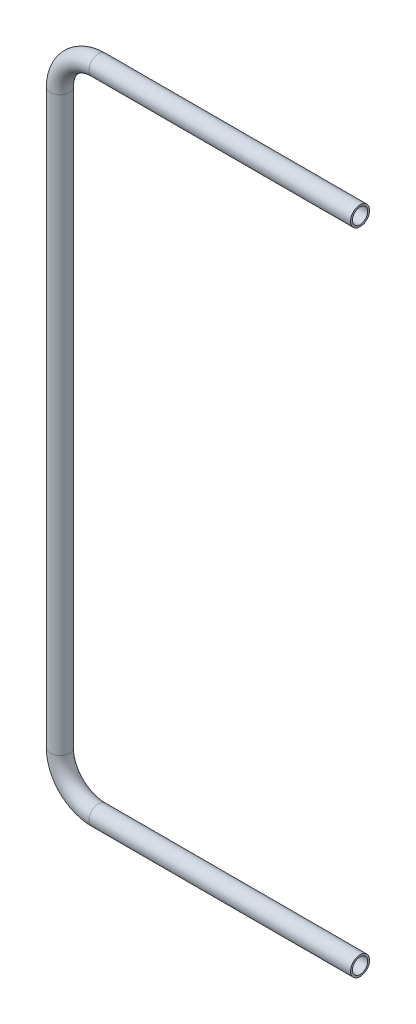
ISO-10303-21;
HEADER;
FILE_DESCRIPTION(('STEP AP214'),'2;1');
FILE_NAME('part.step','',(''),(''),'','','');
FILE_SCHEMA(('AUTOMOTIVE_DESIGN { 1 0 10303 214 1 1 1 1 }'));
ENDSEC;
DATA;
#1=APPLICATION_CONTEXT('core data for automotive mechanical design processes');
#2=APPLICATION_PROTOCOL_DEFINITION('international standard','automotive_design',2000,#1);
#3=PRODUCT_CONTEXT('',#1,'mechanical');
#4=PRODUCT('Part','Part','',(#3));
#5=PRODUCT_RELATED_PRODUCT_CATEGORY('part','',(#4));
#6=PRODUCT_DEFINITION_FORMATION('','',#4);
#7=PRODUCT_DEFINITION_CONTEXT('part definition',#1,'design');
#8=PRODUCT_DEFINITION('design','',#6,#7);
#9=PRODUCT_DEFINITION_SHAPE('','',#8);
#10=(LENGTH_UNIT() NAMED_UNIT(*) SI_UNIT(.MILLI.,.METRE.));
#11=(NAMED_UNIT(*) PLANE_ANGLE_UNIT() SI_UNIT($,.RADIAN.));
#12=(NAMED_UNIT(*) SI_UNIT($,.STERADIAN.) SOLID_ANGLE_UNIT());
#13=UNCERTAINTY_MEASURE_WITH_UNIT(LENGTH_MEASURE(1.E-05),#10,'distance_accuracy_value','');
#14=(GEOMETRIC_REPRESENTATION_CONTEXT(3) GLOBAL_UNCERTAINTY_ASSIGNED_CONTEXT((#13)) GLOBAL_UNIT_ASSIGNED_CONTEXT((#10,
#11,#12)) REPRESENTATION_CONTEXT('',''));
#15=CARTESIAN_POINT('',(0.,0.,0.));
#16=DIRECTION('',(0.,0.,1.));
#17=DIRECTION('',(1.,0.,0.));
#18=AXIS2_PLACEMENT_3D('',#15,#16,#17);
#19=CARTESIAN_POINT('',(0.,0.,0.));
#20=DIRECTION('',(-1.,0.,0.));
#21=DIRECTION('',(0.,-1.,0.));
#22=AXIS2_PLACEMENT_3D('',#19,#20,#21);
#23=CYLINDRICAL_SURFACE('',#22,16.7005);
#24=CARTESIAN_POINT('',(-457.2,0.,0.));
#25=DIRECTION('',(-1.,0.,0.));
#26=DIRECTION('',(0.,0.,1.));
#27=AXIS2_PLACEMENT_3D('',#24,#25,#26);
#28=CIRCLE('',#27,16.7005);
#29=CARTESIAN_POINT('',(-457.2,-16.7005000000001,0.));
#30=VERTEX_POINT('',#29);
#31=EDGE_CURVE('E84',#30,#30,#28,.T.);
#32=ORIENTED_EDGE('',*,*,#31,.F.);
#33=EDGE_LOOP('',(#32));
#34=FACE_BOUND('',#33,.T.);
#35=CARTESIAN_POINT('',(0.,0.,0.));
#36=DIRECTION('',(-1.,0.,0.));
#37=DIRECTION('',(0.,0.,1.));
#38=AXIS2_PLACEMENT_3D('',#35,#36,#37);
#39=CIRCLE('',#38,16.7005);
#40=CARTESIAN_POINT('',(0.,0.,16.7005));
#41=VERTEX_POINT('',#40);
#42=EDGE_CURVE('E52',#41,#41,#39,.T.);
#43=ORIENTED_EDGE('',*,*,#42,.T.);
#44=EDGE_LOOP('',(#43));
#45=FACE_BOUND('',#44,.T.);
#46=ADVANCED_FACE('F37',(#34,#45),#23,.T.);
#47=CARTESIAN_POINT('',(-457.2,67.5004999999999,0.));
#48=DIRECTION('',(0.,0.,1.));
#49=DIRECTION('',(-1.,0.,0.));
#50=AXIS2_PLACEMENT_3D('',#47,#48,#49);
#51=TOROIDAL_SURFACE('',#50,67.5005,16.7005);
#52=CARTESIAN_POINT('',(-524.7005,67.5004999999999,0.));
#53=DIRECTION('',(0.,1.,0.));
#54=DIRECTION('',(0.,0.,1.));
#55=AXIS2_PLACEMENT_3D('',#52,#53,#54);
#56=CIRCLE('',#55,16.7005);
#57=CARTESIAN_POINT('',(-541.401,67.5004999999999,0.));
#58=VERTEX_POINT('',#57);
#59=EDGE_CURVE('E87',#58,#58,#56,.T.);
#60=CARTESIAN_POINT('',(-457.2,67.5004999999999,0.));
#61=DIRECTION('',(0.,0.,1.));
#62=DIRECTION('',(-1.,0.,0.));
#63=AXIS2_PLACEMENT_3D('',#60,#61,#62);
#64=CIRCLE('',#63,84.201);
#65=EDGE_CURVE('',#58,#30,#64,.T.);
#66=ORIENTED_EDGE('',*,*,#59,.F.);
#67=ORIENTED_EDGE('',*,*,#31,.T.);
#68=ORIENTED_EDGE('',*,*,#65,.T.);
#69=ORIENTED_EDGE('',*,*,#65,.F.);
#70=EDGE_LOOP('',(#66,#68,#67,#69));
#71=FACE_BOUND('',#70,.T.);
#72=ADVANCED_FACE('F106',(#71),#51,.T.);
#73=CARTESIAN_POINT('',(-524.7005,67.5004999999999,0.));
#74=DIRECTION('',(0.,1.,0.));
#75=DIRECTION('',(-1.,0.,0.));
#76=AXIS2_PLACEMENT_3D('',#73,#74,#75);
#77=CYLINDRICAL_SURFACE('',#76,16.7005);
#78=CARTESIAN_POINT('',(-524.7005,1067.562,0.));
#79=DIRECTION('',(0.,1.,0.));
#80=DIRECTION('',(0.,0.,1.));
#81=AXIS2_PLACEMENT_3D('',#78,#79,#80);
#82=CIRCLE('',#81,16.7005);
#83=CARTESIAN_POINT('',(-541.401,1067.562,0.));
#84=VERTEX_POINT('',#83);
#85=EDGE_CURVE('E89',#84,#84,#82,.T.);
#86=ORIENTED_EDGE('',*,*,#85,.F.);
#87=EDGE_LOOP('',(#86));
#88=FACE_BOUND('',#87,.T.);
#89=ORIENTED_EDGE('',*,*,#59,.T.);
#90=EDGE_LOOP('',(#89));
#91=FACE_BOUND('',#90,.T.);
#92=ADVANCED_FACE('F99',(#88,#91),#77,.T.);
#93=CARTESIAN_POINT('',(-457.2,1067.562,0.));
#94=DIRECTION('',(0.,0.,1.));
#95=DIRECTION('',(-1.,0.,0.));
#96=AXIS2_PLACEMENT_3D('',#93,#94,#95);
#97=TOROIDAL_SURFACE('',#96,67.5005,16.7005);
#98=CARTESIAN_POINT('',(-457.2,1135.0625,0.));
#99=DIRECTION('',(1.,0.,0.));
#100=DIRECTION('',(0.,0.,1.));
#101=AXIS2_PLACEMENT_3D('',#98,#99,#100);
#102=CIRCLE('',#101,16.7005);
#103=CARTESIAN_POINT('',(-457.2,1151.763,0.));
#104=VERTEX_POINT('',#103);
#105=EDGE_CURVE('E41',#104,#104,#102,.T.);
#106=CARTESIAN_POINT('',(-457.2,1067.562,0.));
#107=DIRECTION('',(0.,0.,1.));
#108=DIRECTION('',(-1.,0.,0.));
#109=AXIS2_PLACEMENT_3D('',#106,#107,#108);
#110=CIRCLE('',#109,84.201);
#111=EDGE_CURVE('',#104,#84,#110,.T.);
#112=ORIENTED_EDGE('',*,*,#105,.F.);
#113=ORIENTED_EDGE('',*,*,#85,.T.);
#114=ORIENTED_EDGE('',*,*,#111,.T.);
#115=ORIENTED_EDGE('',*,*,#111,.F.);
#116=EDGE_LOOP('',(#112,#114,#113,#115));
#117=FACE_BOUND('',#116,.T.);
#118=ADVANCED_FACE('F97',(#117),#97,.T.);
#119=CARTESIAN_POINT('',(-457.2,1135.0625,0.));
#120=DIRECTION('',(1.,0.,0.));
#121=DIRECTION('',(0.,1.,0.));
#122=AXIS2_PLACEMENT_3D('',#119,#120,#121);
#123=CYLINDRICAL_SURFACE('',#122,16.7005);
#124=CARTESIAN_POINT('',(-3.33066907387547E-13,1135.0625,0.));
#125=DIRECTION('',(1.,0.,0.));
#126=DIRECTION('',(0.,0.,1.));
#127=AXIS2_PLACEMENT_3D('',#124,#125,#126);
#128=CIRCLE('',#127,16.7005);
#129=CARTESIAN_POINT('',(-3.33066907387547E-13,1135.0625,16.7005));
#130=VERTEX_POINT('',#129);
#131=EDGE_CURVE('E57',#130,#130,#128,.T.);
#132=ORIENTED_EDGE('',*,*,#131,.F.);
#133=EDGE_LOOP('',(#132));
#134=FACE_BOUND('',#133,.T.);
#135=ORIENTED_EDGE('',*,*,#105,.T.);
#136=EDGE_LOOP('',(#135));
#137=FACE_BOUND('',#136,.T.);
#138=ADVANCED_FACE('F39',(#134,#137),#123,.T.);
#139=CARTESIAN_POINT('',(0.,0.,0.));
#140=DIRECTION('',(1.,0.,0.));
#141=DIRECTION('',(0.,0.,1.));
#142=AXIS2_PLACEMENT_3D('',#139,#140,#141);
#143=PLANE('',#142);
#144=CARTESIAN_POINT('',(0.,0.,0.));
#145=DIRECTION('',(-1.,0.,0.));
#146=DIRECTION('',(0.,0.,1.));
#147=AXIS2_PLACEMENT_3D('',#144,#145,#146);
#148=CIRCLE('',#147,13.335);
#149=CARTESIAN_POINT('',(0.,0.,13.335));
#150=VERTEX_POINT('',#149);
#151=EDGE_CURVE('E82',#150,#150,#148,.F.);
#152=ORIENTED_EDGE('',*,*,#151,.F.);
#153=EDGE_LOOP('',(#152));
#154=FACE_BOUND('',#153,.T.);
#155=ORIENTED_EDGE('',*,*,#42,.F.);
#156=EDGE_LOOP('',(#155));
#157=FACE_BOUND('',#156,.T.);
#158=ADVANCED_FACE('F104',(#154,#157),#143,.T.);
#159=CARTESIAN_POINT('',(-3.33066907387547E-13,1135.0625,0.));
#160=DIRECTION('',(-1.,0.,0.));
#161=DIRECTION('',(0.,0.,1.));
#162=AXIS2_PLACEMENT_3D('',#159,#160,#161);
#163=PLANE('',#162);
#164=CARTESIAN_POINT('',(-3.33066907387547E-13,1135.0625,0.));
#165=DIRECTION('',(1.,0.,0.));
#166=DIRECTION('',(0.,0.,1.));
#167=AXIS2_PLACEMENT_3D('',#164,#165,#166);
#168=CIRCLE('',#167,13.335);
#169=CARTESIAN_POINT('',(-3.33066907387547E-13,1135.0625,13.335));
#170=VERTEX_POINT('',#169);
#171=EDGE_CURVE('E11',#170,#170,#168,.F.);
#172=ORIENTED_EDGE('',*,*,#171,.T.);
#173=EDGE_LOOP('',(#172));
#174=FACE_BOUND('',#173,.T.);
#175=ORIENTED_EDGE('',*,*,#131,.T.);
#176=EDGE_LOOP('',(#175));
#177=FACE_BOUND('',#176,.T.);
#178=ADVANCED_FACE('F64',(#174,#177),#163,.F.);
#179=CARTESIAN_POINT('',(0.,0.,0.));
#180=DIRECTION('',(-1.,0.,0.));
#181=DIRECTION('',(0.,-1.,0.));
#182=AXIS2_PLACEMENT_3D('',#179,#180,#181);
#183=CYLINDRICAL_SURFACE('',#182,13.335);
#184=CARTESIAN_POINT('',(-457.2,0.,0.));
#185=DIRECTION('',(-1.,0.,0.));
#186=DIRECTION('',(0.,0.,1.));
#187=AXIS2_PLACEMENT_3D('',#184,#185,#186);
#188=CIRCLE('',#187,13.335);
#189=CARTESIAN_POINT('',(-457.2,-13.3350000000001,0.));
#190=VERTEX_POINT('',#189);
#191=EDGE_CURVE('E142',#190,#190,#188,.F.);
#192=ORIENTED_EDGE('',*,*,#191,.F.);
#193=EDGE_LOOP('',(#192));
#194=FACE_BOUND('',#193,.T.);
#195=ORIENTED_EDGE('',*,*,#151,.T.);
#196=EDGE_LOOP('',(#195));
#197=FACE_BOUND('',#196,.T.);
#198=ADVANCED_FACE('F123',(#194,#197),#183,.F.);
#199=CARTESIAN_POINT('',(-457.2,67.5004999999999,0.));
#200=DIRECTION('',(0.,0.,1.));
#201=DIRECTION('',(-1.,0.,0.));
#202=AXIS2_PLACEMENT_3D('',#199,#200,#201);
#203=TOROIDAL_SURFACE('',#202,67.5005,13.335);
#204=CARTESIAN_POINT('',(-524.7005,67.5004999999999,0.));
#205=DIRECTION('',(0.,1.,0.));
#206=DIRECTION('',(0.,0.,1.));
#207=AXIS2_PLACEMENT_3D('',#204,#205,#206);
#208=CIRCLE('',#207,13.335);
#209=CARTESIAN_POINT('',(-538.0355,67.5004999999999,0.));
#210=VERTEX_POINT('',#209);
#211=EDGE_CURVE('E77',#210,#210,#208,.F.);
#212=CARTESIAN_POINT('',(-457.2,67.5004999999999,0.));
#213=DIRECTION('',(0.,0.,1.));
#214=DIRECTION('',(-1.,0.,0.));
#215=AXIS2_PLACEMENT_3D('',#212,#213,#214);
#216=CIRCLE('',#215,80.8355);
#217=EDGE_CURVE('',#210,#190,#216,.T.);
#218=ORIENTED_EDGE('',*,*,#211,.F.);
#219=ORIENTED_EDGE('',*,*,#191,.T.);
#220=ORIENTED_EDGE('',*,*,#217,.T.);
#221=ORIENTED_EDGE('',*,*,#217,.F.);
#222=EDGE_LOOP('',(#218,#220,#219,#221));
#223=FACE_BOUND('',#222,.T.);
#224=ADVANCED_FACE('F130',(#223),#203,.F.);
#225=CARTESIAN_POINT('',(-524.7005,67.5004999999999,0.));
#226=DIRECTION('',(0.,1.,0.));
#227=DIRECTION('',(-1.,0.,0.));
#228=AXIS2_PLACEMENT_3D('',#225,#226,#227);
#229=CYLINDRICAL_SURFACE('',#228,13.335);
#230=CARTESIAN_POINT('',(-524.7005,1067.562,0.));
#231=DIRECTION('',(0.,1.,0.));
#232=DIRECTION('',(0.,0.,1.));
#233=AXIS2_PLACEMENT_3D('',#230,#231,#232);
#234=CIRCLE('',#233,13.335);
#235=CARTESIAN_POINT('',(-538.0355,1067.562,0.));
#236=VERTEX_POINT('',#235);
#237=EDGE_CURVE('E74',#236,#236,#234,.F.);
#238=ORIENTED_EDGE('',*,*,#237,.F.);
#239=EDGE_LOOP('',(#238));
#240=FACE_BOUND('',#239,.T.);
#241=ORIENTED_EDGE('',*,*,#211,.T.);
#242=EDGE_LOOP('',(#241));
#243=FACE_BOUND('',#242,.T.);
#244=ADVANCED_FACE('F127',(#240,#243),#229,.F.);
#245=CARTESIAN_POINT('',(-457.2,1067.562,0.));
#246=DIRECTION('',(0.,0.,1.));
#247=DIRECTION('',(-1.,0.,0.));
#248=AXIS2_PLACEMENT_3D('',#245,#246,#247);
#249=TOROIDAL_SURFACE('',#248,67.5005,13.335);
#250=CARTESIAN_POINT('',(-457.2,1135.0625,0.));
#251=DIRECTION('',(1.,0.,0.));
#252=DIRECTION('',(0.,0.,1.));
#253=AXIS2_PLACEMENT_3D('',#250,#251,#252);
#254=CIRCLE('',#253,13.335);
#255=CARTESIAN_POINT('',(-457.2,1148.3975,0.));
#256=VERTEX_POINT('',#255);
#257=EDGE_CURVE('E46',#256,#256,#254,.F.);
#258=CARTESIAN_POINT('',(-457.2,1067.562,0.));
#259=DIRECTION('',(0.,0.,1.));
#260=DIRECTION('',(-1.,0.,0.));
#261=AXIS2_PLACEMENT_3D('',#258,#259,#260);
#262=CIRCLE('',#261,80.8355);
#263=EDGE_CURVE('',#256,#236,#262,.T.);
#264=ORIENTED_EDGE('',*,*,#257,.F.);
#265=ORIENTED_EDGE('',*,*,#237,.T.);
#266=ORIENTED_EDGE('',*,*,#263,.T.);
#267=ORIENTED_EDGE('',*,*,#263,.F.);
#268=EDGE_LOOP('',(#264,#266,#265,#267));
#269=FACE_BOUND('',#268,.T.);
#270=ADVANCED_FACE('F69',(#269),#249,.F.);
#271=CARTESIAN_POINT('',(-457.2,1135.0625,0.));
#272=DIRECTION('',(1.,0.,0.));
#273=DIRECTION('',(0.,1.,0.));
#274=AXIS2_PLACEMENT_3D('',#271,#272,#273);
#275=CYLINDRICAL_SURFACE('',#274,13.335);
#276=ORIENTED_EDGE('',*,*,#171,.F.);
#277=EDGE_LOOP('',(#276));
#278=FACE_BOUND('',#277,.T.);
#279=ORIENTED_EDGE('',*,*,#257,.T.);
#280=EDGE_LOOP('',(#279));
#281=FACE_BOUND('',#280,.T.);
#282=ADVANCED_FACE('F66',(#278,#281),#275,.F.);
#283=CLOSED_SHELL('',(#46,#72,#92,#118,#138,#158,#178,#198,#224,#244,#270,#282));
#284=MANIFOLD_SOLID_BREP('B2',#283);
#285=ADVANCED_BREP_SHAPE_REPRESENTATION('',(#18,#284),#14);
#286=SHAPE_DEFINITION_REPRESENTATION(#9,#285);
ENDSEC;
END-ISO-10303-21;
